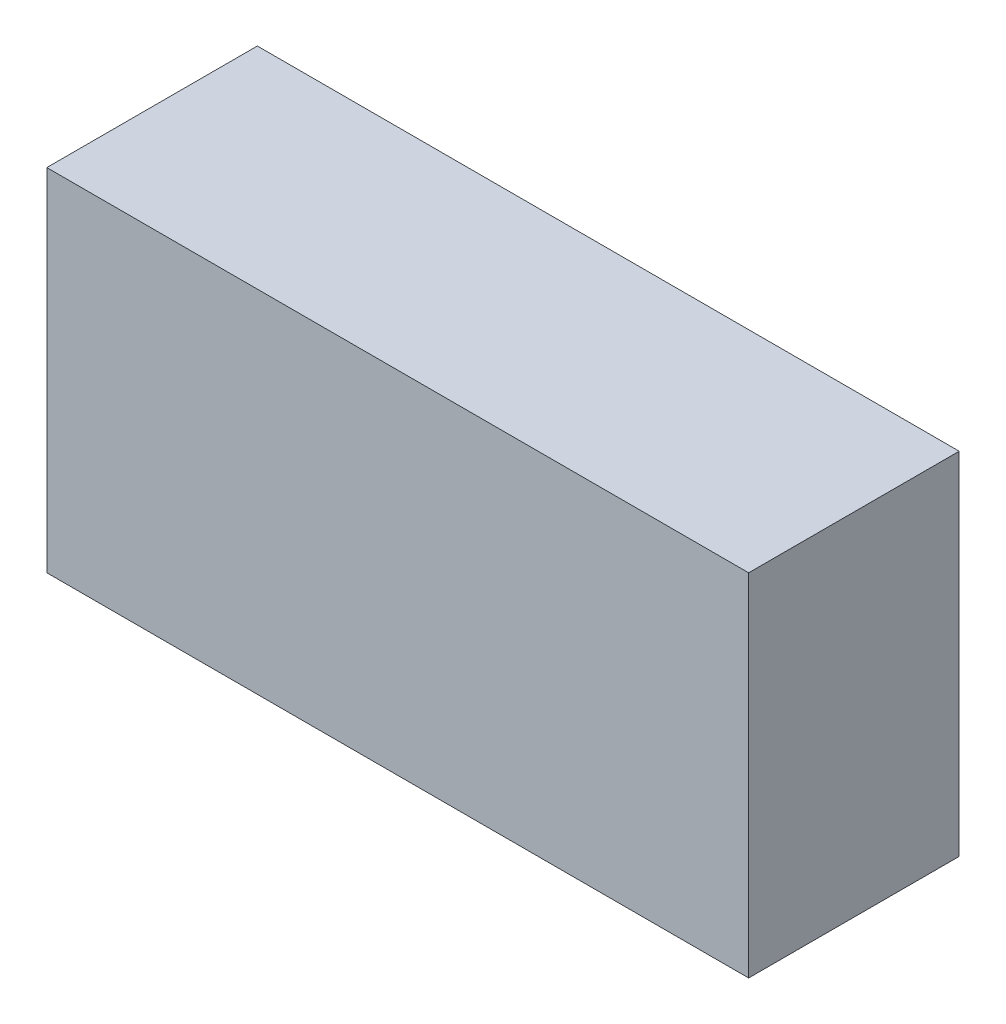
ISO-10303-21;
HEADER;
FILE_DESCRIPTION(('STEP AP214'),'2;1');
FILE_NAME('part.step','',(''),(''),'','','');
FILE_SCHEMA(('AUTOMOTIVE_DESIGN { 1 0 10303 214 1 1 1 1 }'));
ENDSEC;
DATA;
#1=APPLICATION_CONTEXT('core data for automotive mechanical design processes');
#2=APPLICATION_PROTOCOL_DEFINITION('international standard','automotive_design',2000,#1);
#3=PRODUCT_CONTEXT('',#1,'mechanical');
#4=PRODUCT('Part','Part','',(#3));
#5=PRODUCT_RELATED_PRODUCT_CATEGORY('part','',(#4));
#6=PRODUCT_DEFINITION_FORMATION('','',#4);
#7=PRODUCT_DEFINITION_CONTEXT('part definition',#1,'design');
#8=PRODUCT_DEFINITION('design','',#6,#7);
#9=PRODUCT_DEFINITION_SHAPE('','',#8);
#10=(LENGTH_UNIT() NAMED_UNIT(*) SI_UNIT(.MILLI.,.METRE.));
#11=(NAMED_UNIT(*) PLANE_ANGLE_UNIT() SI_UNIT($,.RADIAN.));
#12=(NAMED_UNIT(*) SI_UNIT($,.STERADIAN.) SOLID_ANGLE_UNIT());
#13=UNCERTAINTY_MEASURE_WITH_UNIT(LENGTH_MEASURE(1.E-05),#10,'distance_accuracy_value','');
#14=(GEOMETRIC_REPRESENTATION_CONTEXT(3) GLOBAL_UNCERTAINTY_ASSIGNED_CONTEXT((#13)) GLOBAL_UNIT_ASSIGNED_CONTEXT((#10,
#11,#12)) REPRESENTATION_CONTEXT('',''));
#15=CARTESIAN_POINT('',(0.,0.,0.));
#16=DIRECTION('',(0.,0.,1.));
#17=DIRECTION('',(1.,0.,0.));
#18=AXIS2_PLACEMENT_3D('',#15,#16,#17);
#19=CARTESIAN_POINT('',(5.,-2.5,3.));
#20=DIRECTION('',(-1.,0.,0.));
#21=DIRECTION('',(0.,0.,1.));
#22=AXIS2_PLACEMENT_3D('',#19,#20,#21);
#23=PLANE('',#22);
#24=DIRECTION('',(0.,1.,0.));
#25=VECTOR('',#24,1.);
#26=CARTESIAN_POINT('',(5.,-2.5,0.));
#27=LINE('',#26,#25);
#28=CARTESIAN_POINT('',(5.,-2.5,0.));
#29=VERTEX_POINT('',#28);
#30=CARTESIAN_POINT('',(5.,2.5,0.));
#31=VERTEX_POINT('',#30);
#32=EDGE_CURVE('E111',#29,#31,#27,.T.);
#33=ORIENTED_EDGE('',*,*,#32,.T.);
#34=DIRECTION('',(0.,0.,-1.));
#35=VECTOR('',#34,1.);
#36=CARTESIAN_POINT('',(5.,2.5,3.));
#37=LINE('',#36,#35);
#38=CARTESIAN_POINT('',(5.,2.5,3.));
#39=VERTEX_POINT('',#38);
#40=EDGE_CURVE('E11',#39,#31,#37,.T.);
#41=ORIENTED_EDGE('',*,*,#40,.F.);
#42=DIRECTION('',(0.,1.,0.));
#43=VECTOR('',#42,1.);
#44=CARTESIAN_POINT('',(5.,-2.5,3.));
#45=LINE('',#44,#43);
#46=CARTESIAN_POINT('',(5.,-2.5,3.));
#47=VERTEX_POINT('',#46);
#48=EDGE_CURVE('E95',#47,#39,#45,.T.);
#49=ORIENTED_EDGE('',*,*,#48,.F.);
#50=DIRECTION('',(0.,0.,-1.));
#51=VECTOR('',#50,1.);
#52=CARTESIAN_POINT('',(5.,-2.5,3.));
#53=LINE('',#52,#51);
#54=EDGE_CURVE('E107',#47,#29,#53,.T.);
#55=ORIENTED_EDGE('',*,*,#54,.T.);
#56=EDGE_LOOP('',(#33,#41,#49,#55));
#57=FACE_BOUND('',#56,.T.);
#58=ADVANCED_FACE('F43',(#57),#23,.F.);
#59=CARTESIAN_POINT('',(-5.,2.5,3.));
#60=DIRECTION('',(0.,-1.,0.));
#61=DIRECTION('',(0.,0.,-1.));
#62=AXIS2_PLACEMENT_3D('',#59,#60,#61);
#63=PLANE('',#62);
#64=DIRECTION('',(-1.,0.,0.));
#65=VECTOR('',#64,1.);
#66=CARTESIAN_POINT('',(-5.,2.5,0.));
#67=LINE('',#66,#65);
#68=CARTESIAN_POINT('',(-5.,2.5,0.));
#69=VERTEX_POINT('',#68);
#70=EDGE_CURVE('E100',#31,#69,#67,.T.);
#71=ORIENTED_EDGE('',*,*,#70,.T.);
#72=DIRECTION('',(0.,0.,-1.));
#73=VECTOR('',#72,1.);
#74=CARTESIAN_POINT('',(-5.,2.5,3.));
#75=LINE('',#74,#73);
#76=CARTESIAN_POINT('',(-5.,2.5,3.));
#77=VERTEX_POINT('',#76);
#78=EDGE_CURVE('E52',#77,#69,#75,.T.);
#79=ORIENTED_EDGE('',*,*,#78,.F.);
#80=DIRECTION('',(-1.,0.,0.));
#81=VECTOR('',#80,1.);
#82=CARTESIAN_POINT('',(-5.,2.5,3.));
#83=LINE('',#82,#81);
#84=EDGE_CURVE('E90',#39,#77,#83,.T.);
#85=ORIENTED_EDGE('',*,*,#84,.F.);
#86=ORIENTED_EDGE('',*,*,#40,.T.);
#87=EDGE_LOOP('',(#71,#79,#85,#86));
#88=FACE_BOUND('',#87,.T.);
#89=ADVANCED_FACE('F99',(#88),#63,.F.);
#90=CARTESIAN_POINT('',(-5.,-2.5,3.));
#91=DIRECTION('',(1.,0.,0.));
#92=DIRECTION('',(0.,0.,-1.));
#93=AXIS2_PLACEMENT_3D('',#90,#91,#92);
#94=PLANE('',#93);
#95=DIRECTION('',(0.,-1.,0.));
#96=VECTOR('',#95,1.);
#97=CARTESIAN_POINT('',(-5.,-2.5,0.));
#98=LINE('',#97,#96);
#99=CARTESIAN_POINT('',(-5.,-2.5,0.));
#100=VERTEX_POINT('',#99);
#101=EDGE_CURVE('E77',#69,#100,#98,.T.);
#102=ORIENTED_EDGE('',*,*,#101,.T.);
#103=DIRECTION('',(0.,0.,-1.));
#104=VECTOR('',#103,1.);
#105=CARTESIAN_POINT('',(-5.,-2.5,3.));
#106=LINE('',#105,#104);
#107=CARTESIAN_POINT('',(-5.,-2.5,3.));
#108=VERTEX_POINT('',#107);
#109=EDGE_CURVE('E102',#108,#100,#106,.T.);
#110=ORIENTED_EDGE('',*,*,#109,.F.);
#111=DIRECTION('',(0.,-1.,0.));
#112=VECTOR('',#111,1.);
#113=CARTESIAN_POINT('',(-5.,-2.5,3.));
#114=LINE('',#113,#112);
#115=EDGE_CURVE('E93',#77,#108,#114,.T.);
#116=ORIENTED_EDGE('',*,*,#115,.F.);
#117=ORIENTED_EDGE('',*,*,#78,.T.);
#118=EDGE_LOOP('',(#102,#110,#116,#117));
#119=FACE_BOUND('',#118,.T.);
#120=ADVANCED_FACE('F103',(#119),#94,.F.);
#121=CARTESIAN_POINT('',(-5.,-2.5,3.));
#122=DIRECTION('',(0.,1.,0.));
#123=DIRECTION('',(0.,0.,1.));
#124=AXIS2_PLACEMENT_3D('',#121,#122,#123);
#125=PLANE('',#124);
#126=DIRECTION('',(1.,0.,0.));
#127=VECTOR('',#126,1.);
#128=CARTESIAN_POINT('',(-5.,-2.5,0.));
#129=LINE('',#128,#127);
#130=EDGE_CURVE('E83',#100,#29,#129,.T.);
#131=ORIENTED_EDGE('',*,*,#130,.T.);
#132=ORIENTED_EDGE('',*,*,#54,.F.);
#133=DIRECTION('',(1.,0.,0.));
#134=VECTOR('',#133,1.);
#135=CARTESIAN_POINT('',(-5.,-2.5,3.));
#136=LINE('',#135,#134);
#137=EDGE_CURVE('E60',#108,#47,#136,.T.);
#138=ORIENTED_EDGE('',*,*,#137,.F.);
#139=ORIENTED_EDGE('',*,*,#109,.T.);
#140=EDGE_LOOP('',(#131,#132,#138,#139));
#141=FACE_BOUND('',#140,.T.);
#142=ADVANCED_FACE('F124',(#141),#125,.F.);
#143=CARTESIAN_POINT('',(0.,0.,3.));
#144=DIRECTION('',(0.,0.,-1.));
#145=DIRECTION('',(-1.,0.,0.));
#146=AXIS2_PLACEMENT_3D('',#143,#144,#145);
#147=PLANE('',#146);
#148=ORIENTED_EDGE('',*,*,#48,.T.);
#149=ORIENTED_EDGE('',*,*,#84,.T.);
#150=ORIENTED_EDGE('',*,*,#115,.T.);
#151=ORIENTED_EDGE('',*,*,#137,.T.);
#152=EDGE_LOOP('',(#148,#149,#150,#151));
#153=FACE_BOUND('',#152,.T.);
#154=ADVANCED_FACE('F91',(#153),#147,.F.);
#155=CARTESIAN_POINT('',(0.,0.,0.));
#156=DIRECTION('',(0.,0.,-1.));
#157=DIRECTION('',(-1.,0.,0.));
#158=AXIS2_PLACEMENT_3D('',#155,#156,#157);
#159=PLANE('',#158);
#160=ORIENTED_EDGE('',*,*,#32,.F.);
#161=ORIENTED_EDGE('',*,*,#130,.F.);
#162=ORIENTED_EDGE('',*,*,#101,.F.);
#163=ORIENTED_EDGE('',*,*,#70,.F.);
#164=EDGE_LOOP('',(#160,#161,#162,#163));
#165=FACE_BOUND('',#164,.T.);
#166=ADVANCED_FACE('F127',(#165),#159,.T.);
#167=CLOSED_SHELL('',(#58,#89,#120,#142,#154,#166));
#168=MANIFOLD_SOLID_BREP('B2',#167);
#169=ADVANCED_BREP_SHAPE_REPRESENTATION('',(#18,#168),#14);
#170=SHAPE_DEFINITION_REPRESENTATION(#9,#169);
ENDSEC;
END-ISO-10303-21;
